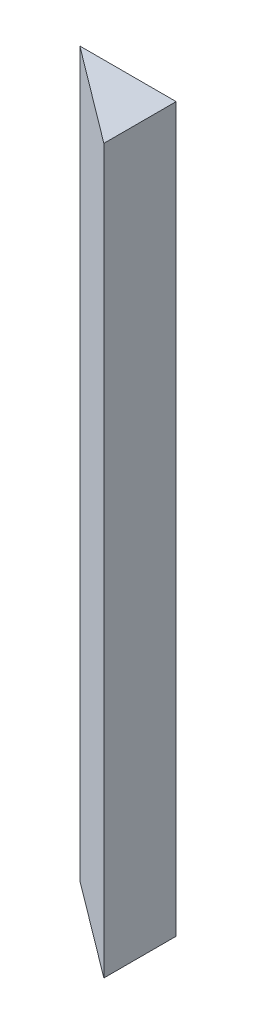
ISO-10303-21;
HEADER;
FILE_DESCRIPTION(('STEP AP214'),'2;1');
FILE_NAME('part.step','',(''),(''),'','','');
FILE_SCHEMA(('AUTOMOTIVE_DESIGN { 1 0 10303 214 1 1 1 1 }'));
ENDSEC;
DATA;
#1=APPLICATION_CONTEXT('core data for automotive mechanical design processes');
#2=APPLICATION_PROTOCOL_DEFINITION('international standard','automotive_design',2000,#1);
#3=PRODUCT_CONTEXT('',#1,'mechanical');
#4=PRODUCT('Part','Part','',(#3));
#5=PRODUCT_RELATED_PRODUCT_CATEGORY('part','',(#4));
#6=PRODUCT_DEFINITION_FORMATION('','',#4);
#7=PRODUCT_DEFINITION_CONTEXT('part definition',#1,'design');
#8=PRODUCT_DEFINITION('design','',#6,#7);
#9=PRODUCT_DEFINITION_SHAPE('','',#8);
#10=(LENGTH_UNIT() NAMED_UNIT(*) SI_UNIT(.MILLI.,.METRE.));
#11=(NAMED_UNIT(*) PLANE_ANGLE_UNIT() SI_UNIT($,.RADIAN.));
#12=(NAMED_UNIT(*) SI_UNIT($,.STERADIAN.) SOLID_ANGLE_UNIT());
#13=UNCERTAINTY_MEASURE_WITH_UNIT(LENGTH_MEASURE(1.E-05),#10,'distance_accuracy_value','');
#14=(GEOMETRIC_REPRESENTATION_CONTEXT(3) GLOBAL_UNCERTAINTY_ASSIGNED_CONTEXT((#13)) GLOBAL_UNIT_ASSIGNED_CONTEXT((#10,
#11,#12)) REPRESENTATION_CONTEXT('',''));
#15=CARTESIAN_POINT('',(0.,0.,0.));
#16=DIRECTION('',(0.,0.,1.));
#17=DIRECTION('',(1.,0.,0.));
#18=AXIS2_PLACEMENT_3D('',#15,#16,#17);
#19=CARTESIAN_POINT('',(3.90666141471174,1.74999961359179,-2.35778278271792));
#20=DIRECTION('',(1.74845553146952E-07,1.,-8.74227765734759E-08));
#21=DIRECTION('',(-1.,1.74845553146952E-07,0.));
#22=AXIS2_PLACEMENT_3D('',#19,#20,#21);
#23=PLANE('',#22);
#24=DIRECTION('',(0.799759704949035,-8.73527647244233E-08,0.600320259811232));
#25=VECTOR('',#24,1.);
#26=CARTESIAN_POINT('',(3.76677813133574,1.74999963863209,-2.35112167398592));
#27=LINE('',#26,#25);
#28=CARTESIAN_POINT('',(3.76677813133574,1.74999963863109,-2.35112167398592));
#29=VERTEX_POINT('',#28);
#30=CARTESIAN_POINT('',(3.90000030597974,1.74999962408006,-2.25112167398592));
#31=VERTEX_POINT('',#30);
#32=EDGE_CURVE('E11',#29,#31,#27,.T.);
#33=ORIENTED_EDGE('',*,*,#32,.T.);
#34=DIRECTION('',(0.,-8.7422775685297E-08,-0.999999999999996));
#35=VECTOR('',#34,1.);
#36=CARTESIAN_POINT('',(3.90000030597974,1.74999962408106,-2.25112167398592));
#37=LINE('',#36,#35);
#38=CARTESIAN_POINT('',(3.90000030597974,1.74999961533778,-2.35112167398592));
#39=VERTEX_POINT('',#38);
#40=EDGE_CURVE('E49',#31,#39,#37,.T.);
#41=ORIENTED_EDGE('',*,*,#40,.T.);
#42=DIRECTION('',(-0.999999999999985,1.74845553322983E-07,0.));
#43=VECTOR('',#42,1.);
#44=CARTESIAN_POINT('',(3.90000030597974,1.74999961533878,-2.35112167398592));
#45=LINE('',#44,#43);
#46=EDGE_CURVE('E47',#39,#29,#45,.T.);
#47=ORIENTED_EDGE('',*,*,#46,.T.);
#48=EDGE_LOOP('',(#33,#41,#47));
#49=FACE_BOUND('',#48,.T.);
#50=ADVANCED_FACE('F17',(#49),#23,.T.);
#51=CARTESIAN_POINT('',(3.90666123986619,0.749999613591785,-2.35778269529515));
#52=DIRECTION('',(1.74845553146952E-07,1.,-8.74227765734759E-08));
#53=DIRECTION('',(-1.,1.74845553146952E-07,0.));
#54=AXIS2_PLACEMENT_3D('',#51,#52,#53);
#55=PLANE('',#54);
#56=DIRECTION('',(-0.999999999999985,1.74845553322983E-07,0.));
#57=VECTOR('',#56,1.);
#58=CARTESIAN_POINT('',(3.90000013113419,0.749999615338783,-2.35112158656315));
#59=LINE('',#58,#57);
#60=CARTESIAN_POINT('',(3.90000013113419,0.749999615339783,-2.35112158656315));
#61=VERTEX_POINT('',#60);
#62=CARTESIAN_POINT('',(3.76677795649019,0.749999638633088,-2.35112158656315));
#63=VERTEX_POINT('',#62);
#64=EDGE_CURVE('E24',#61,#63,#59,.T.);
#65=ORIENTED_EDGE('',*,*,#64,.F.);
#66=DIRECTION('',(0.,-8.74227756852966E-08,-0.999999999999996));
#67=VECTOR('',#66,1.);
#68=CARTESIAN_POINT('',(3.90000013113419,0.749999624081061,-2.25112158656315));
#69=LINE('',#68,#67);
#70=CARTESIAN_POINT('',(3.90000013113419,0.749999624082061,-2.25112158656315));
#71=VERTEX_POINT('',#70);
#72=EDGE_CURVE('E53',#71,#61,#69,.T.);
#73=ORIENTED_EDGE('',*,*,#72,.F.);
#74=DIRECTION('',(0.799759704949032,-8.73527633914448E-08,0.600320259811236));
#75=VECTOR('',#74,1.);
#76=CARTESIAN_POINT('',(3.76677795649019,0.749999638632088,-2.35112158656315));
#77=LINE('',#76,#75);
#78=EDGE_CURVE('E68',#63,#71,#77,.T.);
#79=ORIENTED_EDGE('',*,*,#78,.F.);
#80=EDGE_LOOP('',(#65,#73,#79));
#81=FACE_BOUND('',#80,.T.);
#82=ADVANCED_FACE('F73',(#81),#55,.F.);
#83=CARTESIAN_POINT('',(3.76677813133574,1.74999963863209,-2.35112167398592));
#84=DIRECTION('',(0.600320259811229,-1.74880541890246E-07,-0.799759704949033));
#85=DIRECTION('',(0.799759704949042,-8.73527640504488E-08,0.600320259811241));
#86=AXIS2_PLACEMENT_3D('',#83,#84,#85);
#87=PLANE('',#86);
#88=DIRECTION('',(-1.74845553146948E-07,-0.999999999999981,8.74227765734742E-08));
#89=VECTOR('',#88,1.);
#90=CARTESIAN_POINT('',(3.76677813133574,1.74999963863209,-2.35112167398592));
#91=LINE('',#90,#89);
#92=EDGE_CURVE('E59',#29,#63,#91,.T.);
#93=ORIENTED_EDGE('',*,*,#92,.T.);
#94=ORIENTED_EDGE('',*,*,#78,.T.);
#95=DIRECTION('',(-1.74845553146948E-07,-0.999999999999981,8.74227765734742E-08));
#96=VECTOR('',#95,1.);
#97=CARTESIAN_POINT('',(3.90000030597974,1.74999962408106,-2.25112167398592));
#98=LINE('',#97,#96);
#99=EDGE_CURVE('E54',#31,#71,#98,.T.);
#100=ORIENTED_EDGE('',*,*,#99,.F.);
#101=ORIENTED_EDGE('',*,*,#32,.F.);
#102=EDGE_LOOP('',(#93,#94,#100,#101));
#103=FACE_BOUND('',#102,.T.);
#104=ADVANCED_FACE('F57',(#103),#87,.F.);
#105=CARTESIAN_POINT('',(3.90000030597974,1.74999962408106,-2.25112167398592));
#106=DIRECTION('',(-1.,1.74845553146952E-07,0.));
#107=DIRECTION('',(0.,-8.74227765734759E-08,-1.));
#108=AXIS2_PLACEMENT_3D('',#105,#106,#107);
#109=PLANE('',#108);
#110=ORIENTED_EDGE('',*,*,#99,.T.);
#111=ORIENTED_EDGE('',*,*,#72,.T.);
#112=DIRECTION('',(-1.74845553146948E-07,-0.999999999999981,8.74227765734742E-08));
#113=VECTOR('',#112,1.);
#114=CARTESIAN_POINT('',(3.90000030597974,1.74999961533878,-2.35112167398592));
#115=LINE('',#114,#113);
#116=EDGE_CURVE('E70',#39,#61,#115,.T.);
#117=ORIENTED_EDGE('',*,*,#116,.F.);
#118=ORIENTED_EDGE('',*,*,#40,.F.);
#119=EDGE_LOOP('',(#110,#111,#117,#118));
#120=FACE_BOUND('',#119,.T.);
#121=ADVANCED_FACE('F72',(#120),#109,.F.);
#122=CARTESIAN_POINT('',(3.90000030597974,1.74999961533878,-2.35112167398592));
#123=DIRECTION('',(0.,8.74227765734759E-08,1.));
#124=DIRECTION('',(-1.,1.74845553146952E-07,0.));
#125=AXIS2_PLACEMENT_3D('',#122,#123,#124);
#126=PLANE('',#125);
#127=ORIENTED_EDGE('',*,*,#116,.T.);
#128=ORIENTED_EDGE('',*,*,#64,.T.);
#129=ORIENTED_EDGE('',*,*,#92,.F.);
#130=ORIENTED_EDGE('',*,*,#46,.F.);
#131=EDGE_LOOP('',(#127,#128,#129,#130));
#132=FACE_BOUND('',#131,.T.);
#133=ADVANCED_FACE('F61',(#132),#126,.F.);
#134=CLOSED_SHELL('',(#50,#82,#104,#121,#133));
#135=MANIFOLD_SOLID_BREP('B1',#134);
#136=ADVANCED_BREP_SHAPE_REPRESENTATION('',(#18,#135),#14);
#137=SHAPE_DEFINITION_REPRESENTATION(#9,#136);
ENDSEC;
END-ISO-10303-21;
